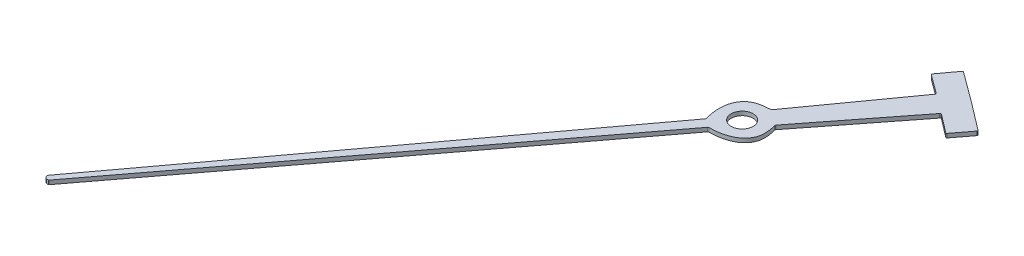
ISO-10303-21;
HEADER;
FILE_DESCRIPTION(('STEP AP214'),'2;1');
FILE_NAME('part.step','',(''),(''),'','','');
FILE_SCHEMA(('AUTOMOTIVE_DESIGN { 1 0 10303 214 1 1 1 1 }'));
ENDSEC;
DATA;
#1=APPLICATION_CONTEXT('core data for automotive mechanical design processes');
#2=APPLICATION_PROTOCOL_DEFINITION('international standard','automotive_design',2000,#1);
#3=PRODUCT_CONTEXT('',#1,'mechanical');
#4=PRODUCT('Part','Part','',(#3));
#5=PRODUCT_RELATED_PRODUCT_CATEGORY('part','',(#4));
#6=PRODUCT_DEFINITION_FORMATION('','',#4);
#7=PRODUCT_DEFINITION_CONTEXT('part definition',#1,'design');
#8=PRODUCT_DEFINITION('design','',#6,#7);
#9=PRODUCT_DEFINITION_SHAPE('','',#8);
#10=(LENGTH_UNIT() NAMED_UNIT(*) SI_UNIT(.MILLI.,.METRE.));
#11=(NAMED_UNIT(*) PLANE_ANGLE_UNIT() SI_UNIT($,.RADIAN.));
#12=(NAMED_UNIT(*) SI_UNIT($,.STERADIAN.) SOLID_ANGLE_UNIT());
#13=UNCERTAINTY_MEASURE_WITH_UNIT(LENGTH_MEASURE(1.E-05),#10,'distance_accuracy_value','');
#14=(GEOMETRIC_REPRESENTATION_CONTEXT(3) GLOBAL_UNCERTAINTY_ASSIGNED_CONTEXT((#13)) GLOBAL_UNIT_ASSIGNED_CONTEXT((#10,
#11,#12)) REPRESENTATION_CONTEXT('',''));
#15=CARTESIAN_POINT('',(0.,0.,0.));
#16=DIRECTION('',(0.,0.,1.));
#17=DIRECTION('',(1.,0.,0.));
#18=AXIS2_PLACEMENT_3D('',#15,#16,#17);
#19=CARTESIAN_POINT('',(32.1899183065593,1.05848,-47.0688155237929));
#20=DIRECTION('',(-0.605978106654896,0.,0.795481322379694));
#21=DIRECTION('',(0.795481322379694,0.,0.605978106654896));
#22=AXIS2_PLACEMENT_3D('',#19,#20,#21);
#23=PLANE('',#22);
#24=DIRECTION('',(-0.795481322379694,0.,-0.605978106654896));
#25=VECTOR('',#24,1.);
#26=CARTESIAN_POINT('',(32.1899183065593,1.05848,-47.0688155237929));
#27=LINE('',#26,#25);
#28=CARTESIAN_POINT('',(33.0273401992961,1.05848,-46.4308881221615));
#29=VERTEX_POINT('',#28);
#30=CARTESIAN_POINT('',(32.1899183065593,1.05848,-47.0688155237929));
#31=VERTEX_POINT('',#30);
#32=EDGE_CURVE('E201',#29,#31,#27,.T.);
#33=ORIENTED_EDGE('',*,*,#32,.F.);
#34=DIRECTION('',(0.,-1.,0.));
#35=VECTOR('',#34,1.);
#36=CARTESIAN_POINT('',(33.0273401992961,1.05848,-46.4308881221615));
#37=LINE('',#36,#35);
#38=CARTESIAN_POINT('',(33.0273401992961,0.941520000000001,-46.4308881221615));
#39=VERTEX_POINT('',#38);
#40=EDGE_CURVE('E311',#29,#39,#37,.T.);
#41=ORIENTED_EDGE('',*,*,#40,.T.);
#42=DIRECTION('',(-0.795481322379694,0.,-0.605978106654896));
#43=VECTOR('',#42,1.);
#44=CARTESIAN_POINT('',(32.1899183065593,0.941520000000001,-47.0688155237929));
#45=LINE('',#44,#43);
#46=CARTESIAN_POINT('',(32.1899183065593,0.941520000000001,-47.0688155237929));
#47=VERTEX_POINT('',#46);
#48=EDGE_CURVE('E225',#39,#47,#45,.T.);
#49=ORIENTED_EDGE('',*,*,#48,.T.);
#50=DIRECTION('',(0.,-1.,0.));
#51=VECTOR('',#50,1.);
#52=CARTESIAN_POINT('',(32.1899183065593,1.05848,-47.0688155237929));
#53=LINE('',#52,#51);
#54=EDGE_CURVE('E219',#31,#47,#53,.T.);
#55=ORIENTED_EDGE('',*,*,#54,.F.);
#56=EDGE_LOOP('',(#33,#41,#49,#55));
#57=FACE_BOUND('',#56,.T.);
#58=ADVANCED_FACE('F34',(#57),#23,.F.);
#59=CARTESIAN_POINT('',(32.1899183065593,1.05848,-47.0688155237929));
#60=DIRECTION('',(-0.592295470716466,0.,0.80572084208413));
#61=DIRECTION('',(0.80572084208413,0.,0.592295470716466));
#62=AXIS2_PLACEMENT_3D('',#59,#60,#61);
#63=PLANE('',#62);
#64=DIRECTION('',(-0.80572084208413,0.,-0.592295470716466));
#65=VECTOR('',#64,1.);
#66=CARTESIAN_POINT('',(32.1899183065593,0.941520000000001,-47.0688155237929));
#67=LINE('',#66,#65);
#68=CARTESIAN_POINT('',(31.3417170306612,0.941520000000001,-47.6923388928433));
#69=VERTEX_POINT('',#68);
#70=EDGE_CURVE('E456',#47,#69,#67,.T.);
#71=ORIENTED_EDGE('',*,*,#70,.T.);
#72=DIRECTION('',(0.,-1.,0.));
#73=VECTOR('',#72,1.);
#74=CARTESIAN_POINT('',(31.3417170306612,1.05848,-47.6923388928433));
#75=LINE('',#74,#73);
#76=CARTESIAN_POINT('',(31.3417170306612,1.05848,-47.6923388928433));
#77=VERTEX_POINT('',#76);
#78=EDGE_CURVE('E221',#69,#77,#75,.F.);
#79=ORIENTED_EDGE('',*,*,#78,.T.);
#80=DIRECTION('',(-0.80572084208413,0.,-0.592295470716466));
#81=VECTOR('',#80,1.);
#82=CARTESIAN_POINT('',(32.1899183065593,1.05848,-47.0688155237929));
#83=LINE('',#82,#81);
#84=EDGE_CURVE('E205',#31,#77,#83,.T.);
#85=ORIENTED_EDGE('',*,*,#84,.F.);
#86=ORIENTED_EDGE('',*,*,#54,.T.);
#87=EDGE_LOOP('',(#71,#79,#85,#86));
#88=FACE_BOUND('',#87,.T.);
#89=ADVANCED_FACE('F218',(#88),#63,.F.);
#90=CARTESIAN_POINT('',(31.3181577532387,1.05848,-47.709657612407));
#91=DIRECTION('',(0.805720842084131,0.,0.592295470716466));
#92=DIRECTION('',(0.592295470716466,0.,-0.805720842084131));
#93=AXIS2_PLACEMENT_3D('',#90,#91,#92);
#94=PLANE('',#93);
#95=DIRECTION('',(-0.592295470716465,0.,0.805720842084131));
#96=VECTOR('',#95,1.);
#97=CARTESIAN_POINT('',(31.3181577532387,0.941520000000001,-47.709657612407));
#98=LINE('',#97,#96);
#99=CARTESIAN_POINT('',(31.3008390336749,0.941520000000001,-47.6860983349845));
#100=VERTEX_POINT('',#99);
#101=CARTESIAN_POINT('',(30.936770156139,0.941520000000001,-47.1908423401513));
#102=VERTEX_POINT('',#101);
#103=EDGE_CURVE('E349',#100,#102,#98,.T.);
#104=ORIENTED_EDGE('',*,*,#103,.T.);
#105=DIRECTION('',(0.,-1.,0.));
#106=VECTOR('',#105,1.);
#107=CARTESIAN_POINT('',(30.936770156139,1.05848,-47.1908423401513));
#108=LINE('',#107,#106);
#109=CARTESIAN_POINT('',(30.936770156139,1.05848,-47.1908423401513));
#110=VERTEX_POINT('',#109);
#111=EDGE_CURVE('E308',#102,#110,#108,.F.);
#112=ORIENTED_EDGE('',*,*,#111,.T.);
#113=DIRECTION('',(-0.592295470716465,0.,0.805720842084131));
#114=VECTOR('',#113,1.);
#115=CARTESIAN_POINT('',(31.3181577532387,1.05848,-47.709657612407));
#116=LINE('',#115,#114);
#117=CARTESIAN_POINT('',(31.3008390336749,1.05848,-47.6860983349845));
#118=VERTEX_POINT('',#117);
#119=EDGE_CURVE('E222',#118,#110,#116,.T.);
#120=ORIENTED_EDGE('',*,*,#119,.F.);
#121=DIRECTION('',(0.,-1.,0.));
#122=VECTOR('',#121,1.);
#123=CARTESIAN_POINT('',(31.3008390336749,1.05848,-47.6860983349845));
#124=LINE('',#123,#122);
#125=EDGE_CURVE('E305',#118,#100,#124,.T.);
#126=ORIENTED_EDGE('',*,*,#125,.T.);
#127=EDGE_LOOP('',(#104,#112,#120,#126));
#128=FACE_BOUND('',#127,.T.);
#129=ADVANCED_FACE('F388',(#128),#94,.F.);
#130=CARTESIAN_POINT('',(30.9194514365753,1.05848,-47.1672830627287));
#131=DIRECTION('',(0.592295470716466,0.,-0.805720842084131));
#132=DIRECTION('',(-0.805720842084131,0.,-0.592295470716466));
#133=AXIS2_PLACEMENT_3D('',#130,#131,#132);
#134=PLANE('',#133);
#135=DIRECTION('',(0.805720842084131,0.,0.592295470716465));
#136=VECTOR('',#135,1.);
#137=CARTESIAN_POINT('',(30.9194514365753,0.941520000000001,-47.1672830627287));
#138=LINE('',#137,#136);
#139=CARTESIAN_POINT('',(30.9430107139978,0.941520000000001,-47.149964343165));
#140=VERTEX_POINT('',#139);
#141=CARTESIAN_POINT('',(31.4815933283321,0.941520000000001,-46.7540455256107));
#142=VERTEX_POINT('',#141);
#143=EDGE_CURVE('E338',#140,#142,#138,.T.);
#144=ORIENTED_EDGE('',*,*,#143,.T.);
#145=DIRECTION('',(0.,-1.,0.));
#146=VECTOR('',#145,1.);
#147=CARTESIAN_POINT('',(31.4815933283321,1.05848,-46.7540455256107));
#148=LINE('',#147,#146);
#149=CARTESIAN_POINT('',(31.4815933283321,1.05848,-46.7540455256107));
#150=VERTEX_POINT('',#149);
#151=EDGE_CURVE('E303',#142,#150,#148,.F.);
#152=ORIENTED_EDGE('',*,*,#151,.T.);
#153=DIRECTION('',(0.805720842084131,0.,0.592295470716465));
#154=VECTOR('',#153,1.);
#155=CARTESIAN_POINT('',(30.9194514365753,1.05848,-47.1672830627287));
#156=LINE('',#155,#154);
#157=CARTESIAN_POINT('',(30.9430107139978,1.05848,-47.149964343165));
#158=VERTEX_POINT('',#157);
#159=EDGE_CURVE('E357',#158,#150,#156,.T.);
#160=ORIENTED_EDGE('',*,*,#159,.F.);
#161=DIRECTION('',(0.,-1.,0.));
#162=VECTOR('',#161,1.);
#163=CARTESIAN_POINT('',(30.9430107139978,1.05848,-47.149964343165));
#164=LINE('',#163,#162);
#165=EDGE_CURVE('E300',#158,#140,#164,.T.);
#166=ORIENTED_EDGE('',*,*,#165,.T.);
#167=EDGE_LOOP('',(#144,#152,#160,#166));
#168=FACE_BOUND('',#167,.T.);
#169=ADVANCED_FACE('F345',(#168),#134,.F.);
#170=CARTESIAN_POINT('',(31.5048720121127,1.05848,-46.7369330739434));
#171=DIRECTION('',(0.812759322746559,0.,0.582599590875718));
#172=DIRECTION('',(0.582599590875718,0.,-0.81275932274656));
#173=AXIS2_PLACEMENT_3D('',#170,#171,#172);
#174=PLANE('',#173);
#175=DIRECTION('',(-0.582599590875718,0.,0.812759322746559));
#176=VECTOR('',#175,1.);
#177=CARTESIAN_POINT('',(31.5048720121127,0.941520000000001,-46.7369330739434));
#178=LINE('',#177,#176);
#179=CARTESIAN_POINT('',(31.4880396913655,0.941520000000001,-46.7134510361509));
#180=VERTEX_POINT('',#179);
#181=CARTESIAN_POINT('',(29.4960705640323,0.941520000000001,-43.9345416372792));
#182=VERTEX_POINT('',#181);
#183=EDGE_CURVE('E340',#180,#182,#178,.T.);
#184=ORIENTED_EDGE('',*,*,#183,.T.);
#185=DIRECTION('',(0.,1.,0.));
#186=VECTOR('',#185,1.);
#187=CARTESIAN_POINT('',(29.4960705640323,1.05848,-43.9345416372792));
#188=LINE('',#187,#186);
#189=CARTESIAN_POINT('',(29.4960705640323,1.05848,-43.9345416372792));
#190=VERTEX_POINT('',#189);
#191=EDGE_CURVE('E284',#182,#190,#188,.T.);
#192=ORIENTED_EDGE('',*,*,#191,.T.);
#193=DIRECTION('',(-0.582599590875718,0.,0.812759322746559));
#194=VECTOR('',#193,1.);
#195=CARTESIAN_POINT('',(31.5048720121127,1.05848,-46.7369330739434));
#196=LINE('',#195,#194);
#197=CARTESIAN_POINT('',(31.4880396913655,1.05848,-46.7134510361509));
#198=VERTEX_POINT('',#197);
#199=EDGE_CURVE('E355',#198,#190,#196,.T.);
#200=ORIENTED_EDGE('',*,*,#199,.F.);
#201=DIRECTION('',(0.,-1.,0.));
#202=VECTOR('',#201,1.);
#203=CARTESIAN_POINT('',(31.4880396913655,0.941520000000001,-46.7134510361509));
#204=LINE('',#203,#202);
#205=EDGE_CURVE('E281',#198,#180,#204,.T.);
#206=ORIENTED_EDGE('',*,*,#205,.T.);
#207=EDGE_LOOP('',(#184,#192,#200,#206));
#208=FACE_BOUND('',#207,.T.);
#209=ADVANCED_FACE('F359',(#208),#174,.F.);
#210=CARTESIAN_POINT('',(29.4876511575013,1.05848,-43.9227960898102));
#211=CARTESIAN_POINT('',(29.1943975643702,1.05848,-43.9146186001798));
#212=CARTESIAN_POINT('',(28.7022898602227,1.05848,-43.7554972211429));
#213=CARTESIAN_POINT('',(28.6302859125263,1.05848,-43.1735217844957));
#214=CARTESIAN_POINT('',(28.7609984101812,1.05848,-42.7426059162903));
#215=B_SPLINE_CURVE_WITH_KNOTS('',3,(#210,#211,#212,#213,#214),.UNSPECIFIED.,.F.,.F.,(4,1,4),
(0.,0.358150980857874,1.),.UNSPECIFIED.);
#216=DIRECTION('',(0.,-1.,0.));
#217=VECTOR('',#216,1.);
#218=SURFACE_OF_LINEAR_EXTRUSION('',#215,#217);
#219=CARTESIAN_POINT('',(29.4876511575013,0.941520000000001,-43.9227960898102));
#220=CARTESIAN_POINT('',(29.1943975643702,0.941520000000001,-43.9146186001798));
#221=CARTESIAN_POINT('',(28.7022898602227,0.941520000000001,-43.7554972211429));
#222=CARTESIAN_POINT('',(28.6302859125263,0.941520000000001,-43.1735217844957));
#223=CARTESIAN_POINT('',(28.7609984101812,0.941520000000001,-42.7426059162903));
#224=B_SPLINE_CURVE_WITH_KNOTS('',3,(#219,#220,#221,#222,#223),.UNSPECIFIED.,.F.,.F.,(4,1,4),
(0.,0.358150980857874,1.),.UNSPECIFIED.);
#225=CARTESIAN_POINT('',(29.4732932365023,0.941520000000001,-43.9223535377325));
#226=VERTEX_POINT('',#225);
#227=CARTESIAN_POINT('',(28.7568304404569,0.941520000000001,-42.7565297274636));
#228=VERTEX_POINT('',#227);
#229=EDGE_CURVE('E463',#226,#228,#224,.T.);
#230=ORIENTED_EDGE('',*,*,#229,.T.);
#231=DIRECTION('',(0.,-1.,0.));
#232=VECTOR('',#231,1.);
#233=CARTESIAN_POINT('',(28.7568304404569,0.941520000000001,-42.7565297274636));
#234=LINE('',#233,#232);
#235=CARTESIAN_POINT('',(28.7568304404569,1.05848,-42.7565297274636));
#236=VERTEX_POINT('',#235);
#237=EDGE_CURVE('E274',#228,#236,#234,.F.);
#238=ORIENTED_EDGE('',*,*,#237,.T.);
#239=CARTESIAN_POINT('',(29.4732932365023,1.05848,-43.9223535377325));
#240=VERTEX_POINT('',#239);
#241=EDGE_CURVE('E361',#240,#236,#215,.T.);
#242=ORIENTED_EDGE('',*,*,#241,.F.);
#243=DIRECTION('',(0.,-1.,0.));
#244=VECTOR('',#243,1.);
#245=CARTESIAN_POINT('',(29.4732932365023,1.05848,-43.9223535377325));
#246=LINE('',#245,#244);
#247=EDGE_CURVE('E271',#240,#226,#246,.T.);
#248=ORIENTED_EDGE('',*,*,#247,.T.);
#249=EDGE_LOOP('',(#230,#238,#242,#248));
#250=FACE_BOUND('',#249,.T.);
#251=ADVANCED_FACE('F377',(#250),#218,.F.);
#252=CARTESIAN_POINT('',(28.7609984101812,1.05848,-42.7426059162903));
#253=DIRECTION('',(0.803510268686839,0.,0.595290893693835));
#254=DIRECTION('',(0.595290893693835,0.,-0.803510268686839));
#255=AXIS2_PLACEMENT_3D('',#252,#253,#254);
#256=PLANE('',#255);
#257=DIRECTION('',(-0.595290893693835,0.,0.803510268686839));
#258=VECTOR('',#257,1.);
#259=CARTESIAN_POINT('',(28.7609984101812,0.941520000000001,-42.7426059162903));
#260=LINE('',#259,#258);
#261=CARTESIAN_POINT('',(28.752282512802,0.941520000000001,-42.7308413939043));
#262=VERTEX_POINT('',#261);
#263=CARTESIAN_POINT('',(20.564809879345,0.941520000000001,-31.6795748530143));
#264=VERTEX_POINT('',#263);
#265=EDGE_CURVE('E468',#262,#264,#260,.T.);
#266=ORIENTED_EDGE('',*,*,#265,.T.);
#267=DIRECTION('',(0.,-1.,0.));
#268=VECTOR('',#267,1.);
#269=CARTESIAN_POINT('',(20.564809879345,1.05848,-31.6795748530143));
#270=LINE('',#269,#268);
#271=CARTESIAN_POINT('',(20.564809879345,1.05848,-31.6795748530143));
#272=VERTEX_POINT('',#271);
#273=EDGE_CURVE('E269',#264,#272,#270,.F.);
#274=ORIENTED_EDGE('',*,*,#273,.T.);
#275=DIRECTION('',(-0.595290893693835,0.,0.803510268686839));
#276=VECTOR('',#275,1.);
#277=CARTESIAN_POINT('',(28.7609984101812,1.05848,-42.7426059162903));
#278=LINE('',#277,#276);
#279=CARTESIAN_POINT('',(28.752282512802,1.05848,-42.7308413939043));
#280=VERTEX_POINT('',#279);
#281=EDGE_CURVE('E364',#280,#272,#278,.T.);
#282=ORIENTED_EDGE('',*,*,#281,.F.);
#283=DIRECTION('',(0.,1.,0.));
#284=VECTOR('',#283,1.);
#285=CARTESIAN_POINT('',(28.752282512802,0.941520000000001,-42.7308413939043));
#286=LINE('',#285,#284);
#287=EDGE_CURVE('E266',#280,#262,#286,.F.);
#288=ORIENTED_EDGE('',*,*,#287,.T.);
#289=EDGE_LOOP('',(#266,#274,#282,#288));
#290=FACE_BOUND('',#289,.T.);
#291=ADVANCED_FACE('F381',(#290),#256,.F.);
#292=CARTESIAN_POINT('',(20.6631527987761,1.05848,-31.6660876085053));
#293=DIRECTION('',(0.,-1.,0.));
#294=DIRECTION('',(0.,0.,-1.));
#295=AXIS2_PLACEMENT_3D('',#292,#293,#294);
#296=CYLINDRICAL_SURFACE('',#295,0.104190810110918);
#297=CARTESIAN_POINT('',(20.6631527987761,0.941520000000001,-31.6660876085053));
#298=DIRECTION('',(0.,1.,0.));
#299=DIRECTION('',(0.,0.,-1.));
#300=AXIS2_PLACEMENT_3D('',#297,#298,#299);
#301=CIRCLE('',#300,0.104190810110918);
#302=CARTESIAN_POINT('',(20.5591045192301,0.941520000000001,-31.6606396331859));
#303=VERTEX_POINT('',#302);
#304=CARTESIAN_POINT('',(20.6872694274349,0.941520000000001,-31.5647263085249));
#305=VERTEX_POINT('',#304);
#306=EDGE_CURVE('E474',#303,#305,#301,.T.);
#307=ORIENTED_EDGE('',*,*,#306,.T.);
#308=DIRECTION('',(0.,-1.,0.));
#309=VECTOR('',#308,1.);
#310=CARTESIAN_POINT('',(20.6872694274349,1.05848,-31.5647263085249));
#311=LINE('',#310,#309);
#312=CARTESIAN_POINT('',(20.6872694274349,1.05848,-31.5647263085249));
#313=VERTEX_POINT('',#312);
#314=EDGE_CURVE('E254',#305,#313,#311,.F.);
#315=ORIENTED_EDGE('',*,*,#314,.T.);
#316=CARTESIAN_POINT('',(20.6631527987761,1.05848,-31.6660876085053));
#317=DIRECTION('',(0.,1.,0.));
#318=DIRECTION('',(0.,0.,-1.));
#319=AXIS2_PLACEMENT_3D('',#316,#317,#318);
#320=CIRCLE('',#319,0.104190810110918);
#321=CARTESIAN_POINT('',(20.5591045192301,1.05848,-31.6606396331859));
#322=VERTEX_POINT('',#321);
#323=EDGE_CURVE('E543',#322,#313,#320,.T.);
#324=ORIENTED_EDGE('',*,*,#323,.F.);
#325=DIRECTION('',(0.,-1.,0.));
#326=VECTOR('',#325,1.);
#327=CARTESIAN_POINT('',(20.5591045192301,1.05848,-31.6606396331859));
#328=LINE('',#327,#326);
#329=EDGE_CURVE('E251',#322,#303,#328,.T.);
#330=ORIENTED_EDGE('',*,*,#329,.T.);
#331=EDGE_LOOP('',(#307,#315,#324,#330));
#332=FACE_BOUND('',#331,.T.);
#333=ADVANCED_FACE('F526',(#332),#296,.T.);
#334=CARTESIAN_POINT('',(29.0063295391709,1.05848,-42.5590102304366));
#335=DIRECTION('',(-0.7977317376354,0.,-0.603012499679074));
#336=DIRECTION('',(-0.603012499679074,0.,0.7977317376354));
#337=AXIS2_PLACEMENT_3D('',#334,#335,#336);
#338=PLANE('',#337);
#339=DIRECTION('',(0.603012499679074,0.,-0.7977317376354));
#340=VECTOR('',#339,1.);
#341=CARTESIAN_POINT('',(29.0063295391709,1.05848,-42.5590102304366));
#342=LINE('',#341,#340);
#343=CARTESIAN_POINT('',(20.7038270379946,1.05848,-31.57554015227));
#344=VERTEX_POINT('',#343);
#345=CARTESIAN_POINT('',(28.9975005866012,1.05848,-42.5473303138866));
#346=VERTEX_POINT('',#345);
#347=EDGE_CURVE('E512',#344,#346,#342,.T.);
#348=ORIENTED_EDGE('',*,*,#347,.F.);
#349=DIRECTION('',(0.,-1.,0.));
#350=VECTOR('',#349,1.);
#351=CARTESIAN_POINT('',(20.7038270379946,1.05848,-31.57554015227));
#352=LINE('',#351,#350);
#353=CARTESIAN_POINT('',(20.7038270379946,0.941520000000001,-31.57554015227));
#354=VERTEX_POINT('',#353);
#355=EDGE_CURVE('E230',#344,#354,#352,.T.);
#356=ORIENTED_EDGE('',*,*,#355,.T.);
#357=DIRECTION('',(0.603012499679074,0.,-0.7977317376354));
#358=VECTOR('',#357,1.);
#359=CARTESIAN_POINT('',(29.0063295391709,0.941520000000001,-42.5590102304366));
#360=LINE('',#359,#358);
#361=CARTESIAN_POINT('',(28.9975005866012,0.941520000000001,-42.5473303138866));
#362=VERTEX_POINT('',#361);
#363=EDGE_CURVE('E477',#354,#362,#360,.T.);
#364=ORIENTED_EDGE('',*,*,#363,.T.);
#365=DIRECTION('',(0.,1.,0.));
#366=VECTOR('',#365,1.);
#367=CARTESIAN_POINT('',(28.9975005866012,1.05848,-42.5473303138866));
#368=LINE('',#367,#366);
#369=EDGE_CURVE('E227',#362,#346,#368,.T.);
#370=ORIENTED_EDGE('',*,*,#369,.T.);
#371=EDGE_LOOP('',(#348,#356,#364,#370));
#372=FACE_BOUND('',#371,.T.);
#373=ADVANCED_FACE('F522',(#372),#338,.F.);
#374=CARTESIAN_POINT('',(29.0063295391709,1.05848,-42.5590102304366));
#375=CARTESIAN_POINT('',(29.4566174267421,1.05848,-42.5551294030654));
#376=CARTESIAN_POINT('',(29.9946636056733,1.05848,-42.7883380793237));
#377=CARTESIAN_POINT('',(30.008542987962,1.05848,-43.3053457857414));
#378=CARTESIAN_POINT('',(29.9336858154135,1.05848,-43.5890021710722));
#379=B_SPLINE_CURVE_WITH_KNOTS('',3,(#374,#375,#376,#377,#378),.UNSPECIFIED.,.F.,.F.,(4,1,4),
(0.,0.641849019142126,1.),.UNSPECIFIED.);
#380=DIRECTION('',(0.,-1.,0.));
#381=VECTOR('',#380,1.);
#382=SURFACE_OF_LINEAR_EXTRUSION('',#379,#381);
#383=CARTESIAN_POINT('',(29.0208636129798,1.05848,-42.5589382045408));
#384=VERTEX_POINT('',#383);
#385=CARTESIAN_POINT('',(29.9373104160822,1.05848,-43.5751022423765));
#386=VERTEX_POINT('',#385);
#387=EDGE_CURVE('E504',#384,#386,#379,.T.);
#388=ORIENTED_EDGE('',*,*,#387,.F.);
#389=DIRECTION('',(0.,-1.,0.));
#390=VECTOR('',#389,1.);
#391=CARTESIAN_POINT('',(29.0208636129798,1.05848,-42.5589382045408));
#392=LINE('',#391,#390);
#393=CARTESIAN_POINT('',(29.0208636129798,0.941520000000001,-42.5589382045408));
#394=VERTEX_POINT('',#393);
#395=EDGE_CURVE('E278',#384,#394,#392,.T.);
#396=ORIENTED_EDGE('',*,*,#395,.T.);
#397=CARTESIAN_POINT('',(29.0063295391709,0.941520000000001,-42.5590102304366));
#398=CARTESIAN_POINT('',(29.4566174267421,0.941520000000001,-42.5551294030654));
#399=CARTESIAN_POINT('',(29.9946636056733,0.941520000000001,-42.7883380793237));
#400=CARTESIAN_POINT('',(30.008542987962,0.941520000000001,-43.3053457857414));
#401=CARTESIAN_POINT('',(29.9336858154135,0.941520000000001,-43.5890021710722));
#402=B_SPLINE_CURVE_WITH_KNOTS('',3,(#397,#398,#399,#400,#401),.UNSPECIFIED.,.F.,.F.,(4,1,4),
(0.,0.641849019142126,1.),.UNSPECIFIED.);
#403=CARTESIAN_POINT('',(29.9373104160822,0.941520000000001,-43.5751022423765));
#404=VERTEX_POINT('',#403);
#405=EDGE_CURVE('E480',#394,#404,#402,.T.);
#406=ORIENTED_EDGE('',*,*,#405,.T.);
#407=DIRECTION('',(0.,-1.,0.));
#408=VECTOR('',#407,1.);
#409=CARTESIAN_POINT('',(29.9373104160822,0.941520000000001,-43.5751022423765));
#410=LINE('',#409,#408);
#411=EDGE_CURVE('E276',#404,#386,#410,.F.);
#412=ORIENTED_EDGE('',*,*,#411,.T.);
#413=EDGE_LOOP('',(#388,#396,#406,#412));
#414=FACE_BOUND('',#413,.T.);
#415=ADVANCED_FACE('F517',(#414),#382,.F.);
#416=CARTESIAN_POINT('',(32.0647024833299,1.05848,-46.3179790677879));
#417=DIRECTION('',(-0.788163983086571,0.,-0.615465300212052));
#418=DIRECTION('',(-0.615465300212052,0.,0.788163983086571));
#419=AXIS2_PLACEMENT_3D('',#416,#417,#418);
#420=PLANE('',#419);
#421=DIRECTION('',(0.615465300212052,0.,-0.788163983086571));
#422=VECTOR('',#421,1.);
#423=CARTESIAN_POINT('',(32.0647024833299,1.05848,-46.3179790677879));
#424=LINE('',#423,#422);
#425=CARTESIAN_POINT('',(29.9425801789684,1.05848,-43.6003922803182));
#426=VERTEX_POINT('',#425);
#427=CARTESIAN_POINT('',(32.0469206147803,1.05848,-46.2952076323586));
#428=VERTEX_POINT('',#427);
#429=EDGE_CURVE('E503',#426,#428,#424,.T.);
#430=ORIENTED_EDGE('',*,*,#429,.F.);
#431=DIRECTION('',(0.,1.,0.));
#432=VECTOR('',#431,1.);
#433=CARTESIAN_POINT('',(29.9425801789684,0.941520000000001,-43.6003922803182));
#434=LINE('',#433,#432);
#435=CARTESIAN_POINT('',(29.9425801789684,0.941520000000001,-43.6003922803182));
#436=VERTEX_POINT('',#435);
#437=EDGE_CURVE('E288',#426,#436,#434,.F.);
#438=ORIENTED_EDGE('',*,*,#437,.T.);
#439=DIRECTION('',(0.615465300212052,0.,-0.788163983086571));
#440=VECTOR('',#439,1.);
#441=CARTESIAN_POINT('',(32.0647024833299,0.941520000000001,-46.3179790677879));
#442=LINE('',#441,#440);
#443=CARTESIAN_POINT('',(32.0469206147803,0.941520000000001,-46.2952076323586));
#444=VERTEX_POINT('',#443);
#445=EDGE_CURVE('E485',#436,#444,#442,.T.);
#446=ORIENTED_EDGE('',*,*,#445,.T.);
#447=DIRECTION('',(0.,-1.,0.));
#448=VECTOR('',#447,1.);
#449=CARTESIAN_POINT('',(32.0469206147803,1.05848,-46.2952076323586));
#450=LINE('',#449,#448);
#451=EDGE_CURVE('E286',#444,#428,#450,.F.);
#452=ORIENTED_EDGE('',*,*,#451,.T.);
#453=EDGE_LOOP('',(#430,#438,#446,#452));
#454=FACE_BOUND('',#453,.T.);
#455=ADVANCED_FACE('F521',(#454),#420,.F.);
#456=CARTESIAN_POINT('',(32.6426832295797,1.05848,-45.8776875506374));
#457=DIRECTION('',(0.605978106654896,0.,-0.795481322379694));
#458=DIRECTION('',(-0.795481322379694,0.,-0.605978106654896));
#459=AXIS2_PLACEMENT_3D('',#456,#457,#458);
#460=PLANE('',#459);
#461=DIRECTION('',(0.795481322379694,0.,0.605978106654896));
#462=VECTOR('',#461,1.);
#463=CARTESIAN_POINT('',(32.6426832295797,0.941520000000001,-45.8776875506374));
#464=LINE('',#463,#462);
#465=CARTESIAN_POINT('',(32.0876853294843,0.941520000000001,-46.3004713008468));
#466=VERTEX_POINT('',#465);
#467=CARTESIAN_POINT('',(32.6194233557133,0.941520000000001,-45.895406350476));
#468=VERTEX_POINT('',#467);
#469=EDGE_CURVE('E490',#466,#468,#464,.T.);
#470=ORIENTED_EDGE('',*,*,#469,.T.);
#471=DIRECTION('',(0.,-1.,0.));
#472=VECTOR('',#471,1.);
#473=CARTESIAN_POINT('',(32.6194233557133,1.05848,-45.895406350476));
#474=LINE('',#473,#472);
#475=CARTESIAN_POINT('',(32.6194233557133,1.05848,-45.895406350476));
#476=VERTEX_POINT('',#475);
#477=EDGE_CURVE('E298',#468,#476,#474,.F.);
#478=ORIENTED_EDGE('',*,*,#477,.T.);
#479=DIRECTION('',(0.795481322379694,0.,0.605978106654896));
#480=VECTOR('',#479,1.);
#481=CARTESIAN_POINT('',(32.6426832295797,1.05848,-45.8776875506374));
#482=LINE('',#481,#480);
#483=CARTESIAN_POINT('',(32.0876853294843,1.05848,-46.3004713008468));
#484=VERTEX_POINT('',#483);
#485=EDGE_CURVE('E232',#484,#476,#482,.T.);
#486=ORIENTED_EDGE('',*,*,#485,.F.);
#487=DIRECTION('',(0.,-1.,0.));
#488=VECTOR('',#487,1.);
#489=CARTESIAN_POINT('',(32.0876853294843,0.941520000000001,-46.3004713008468));
#490=LINE('',#489,#488);
#491=EDGE_CURVE('E295',#484,#466,#490,.T.);
#492=ORIENTED_EDGE('',*,*,#491,.T.);
#493=EDGE_LOOP('',(#470,#478,#486,#492));
#494=FACE_BOUND('',#493,.T.);
#495=ADVANCED_FACE('F499',(#494),#460,.F.);
#496=CARTESIAN_POINT('',(33.0506000731625,1.05848,-46.4131693223229));
#497=DIRECTION('',(-0.795481322379694,0.,-0.605978106654897));
#498=DIRECTION('',(-0.605978106654897,0.,0.795481322379694));
#499=AXIS2_PLACEMENT_3D('',#496,#497,#498);
#500=PLANE('',#499);
#501=DIRECTION('',(0.605978106654897,0.,-0.795481322379694));
#502=VECTOR('',#501,1.);
#503=CARTESIAN_POINT('',(33.0506000731625,1.05848,-46.4131693223229));
#504=LINE('',#503,#502);
#505=CARTESIAN_POINT('',(32.6604020294183,1.05848,-45.9009474245038));
#506=VERTEX_POINT('',#505);
#507=CARTESIAN_POINT('',(33.0328812733239,1.05848,-46.3899094484565));
#508=VERTEX_POINT('',#507);
#509=EDGE_CURVE('E228',#506,#508,#504,.T.);
#510=ORIENTED_EDGE('',*,*,#509,.F.);
#511=DIRECTION('',(0.,-1.,0.));
#512=VECTOR('',#511,1.);
#513=CARTESIAN_POINT('',(32.6604020294183,1.05848,-45.9009474245038));
#514=LINE('',#513,#512);
#515=CARTESIAN_POINT('',(32.6604020294183,0.941520000000001,-45.9009474245038));
#516=VERTEX_POINT('',#515);
#517=EDGE_CURVE('E292',#506,#516,#514,.T.);
#518=ORIENTED_EDGE('',*,*,#517,.T.);
#519=DIRECTION('',(0.605978106654897,0.,-0.795481322379694));
#520=VECTOR('',#519,1.);
#521=CARTESIAN_POINT('',(33.0506000731625,0.941520000000001,-46.4131693223229));
#522=LINE('',#521,#520);
#523=CARTESIAN_POINT('',(33.0328812733239,0.941520000000001,-46.3899094484565));
#524=VERTEX_POINT('',#523);
#525=EDGE_CURVE('E213',#516,#524,#522,.T.);
#526=ORIENTED_EDGE('',*,*,#525,.T.);
#527=DIRECTION('',(0.,-1.,0.));
#528=VECTOR('',#527,1.);
#529=CARTESIAN_POINT('',(33.0328812733239,1.05848,-46.3899094484565));
#530=LINE('',#529,#528);
#531=EDGE_CURVE('E49',#524,#508,#530,.F.);
#532=ORIENTED_EDGE('',*,*,#531,.T.);
#533=EDGE_LOOP('',(#510,#518,#526,#532));
#534=FACE_BOUND('',#533,.T.);
#535=ADVANCED_FACE('F496',(#534),#500,.F.);
#536=CARTESIAN_POINT('',(29.8151281235502,1.05848,-42.8121850549404));
#537=DIRECTION('',(0.,-1.,0.));
#538=DIRECTION('',(0.,0.,-1.));
#539=AXIS2_PLACEMENT_3D('',#536,#537,#538);
#540=PLANE('',#539);
#541=CARTESIAN_POINT('',(29.3208981962811,1.05848,-43.2350656212496));
#542=DIRECTION('',(0.,1.,0.));
#543=DIRECTION('',(0.,0.,1.));
#544=AXIS2_PLACEMENT_3D('',#541,#542,#543);
#545=CIRCLE('',#544,0.32164);
#546=CARTESIAN_POINT('',(29.3208981962811,1.05848,-42.9134256212496));
#547=VERTEX_POINT('',#546);
#548=EDGE_CURVE('E449',#547,#547,#545,.T.);
#549=ORIENTED_EDGE('',*,*,#548,.F.);
#550=EDGE_LOOP('',(#549));
#551=FACE_BOUND('',#550,.T.);
#552=ORIENTED_EDGE('',*,*,#323,.T.);
#553=CARTESIAN_POINT('',(20.6805013619862,1.05848,-31.5931722377606));
#554=DIRECTION('',(0.,-1.,0.));
#555=DIRECTION('',(0.,0.,-1.));
#556=AXIS2_PLACEMENT_3D('',#553,#554,#555);
#557=CIRCLE('',#556,0.02924);
#558=EDGE_CURVE('E264',#313,#344,#557,.F.);
#559=ORIENTED_EDGE('',*,*,#558,.T.);
#560=ORIENTED_EDGE('',*,*,#347,.T.);
#561=CARTESIAN_POINT('',(29.0208262626097,1.05848,-42.529698228396));
#562=DIRECTION('',(0.,-1.,0.));
#563=DIRECTION('',(0.,0.,-1.));
#564=AXIS2_PLACEMENT_3D('',#561,#562,#563);
#565=CIRCLE('',#564,0.02924);
#566=EDGE_CURVE('E319',#346,#384,#565,.T.);
#567=ORIENTED_EDGE('',*,*,#566,.T.);
#568=ORIENTED_EDGE('',*,*,#387,.T.);
#569=CARTESIAN_POINT('',(29.9656260938339,1.05848,-43.58239607494));
#570=DIRECTION('',(0.,-1.,0.));
#571=DIRECTION('',(0.,0.,-1.));
#572=AXIS2_PLACEMENT_3D('',#569,#570,#571);
#573=CIRCLE('',#572,0.02924);
#574=EDGE_CURVE('E327',#386,#426,#573,.T.);
#575=ORIENTED_EDGE('',*,*,#574,.T.);
#576=ORIENTED_EDGE('',*,*,#429,.T.);
#577=CARTESIAN_POINT('',(32.0699665296458,1.05848,-46.2772114269804));
#578=DIRECTION('',(0.,-1.,0.));
#579=DIRECTION('',(0.,0.,-1.));
#580=AXIS2_PLACEMENT_3D('',#577,#578,#579);
#581=CIRCLE('',#580,0.02924);
#582=EDGE_CURVE('E331',#428,#484,#581,.T.);
#583=ORIENTED_EDGE('',*,*,#582,.T.);
#584=ORIENTED_EDGE('',*,*,#485,.T.);
#585=CARTESIAN_POINT('',(32.6371421555519,1.05848,-45.9186662243424));
#586=DIRECTION('',(0.,-1.,0.));
#587=DIRECTION('',(0.,0.,-1.));
#588=AXIS2_PLACEMENT_3D('',#585,#586,#587);
#589=CIRCLE('',#588,0.02924);
#590=EDGE_CURVE('E56',#476,#506,#589,.F.);
#591=ORIENTED_EDGE('',*,*,#590,.T.);
#592=ORIENTED_EDGE('',*,*,#509,.T.);
#593=CARTESIAN_POINT('',(33.0096213994575,1.05848,-46.4076282482951));
#594=DIRECTION('',(0.,-1.,0.));
#595=DIRECTION('',(0.,0.,-1.));
#596=AXIS2_PLACEMENT_3D('',#593,#594,#595);
#597=CIRCLE('',#596,0.02924);
#598=EDGE_CURVE('E208',#508,#29,#597,.F.);
#599=ORIENTED_EDGE('',*,*,#598,.T.);
#600=ORIENTED_EDGE('',*,*,#32,.T.);
#601=ORIENTED_EDGE('',*,*,#84,.T.);
#602=CARTESIAN_POINT('',(31.3243983110975,1.05848,-47.6687796154207));
#603=DIRECTION('',(0.,-1.,0.));
#604=DIRECTION('',(0.,0.,-1.));
#605=AXIS2_PLACEMENT_3D('',#602,#603,#604);
#606=CIRCLE('',#605,0.02924);
#607=EDGE_CURVE('E257',#77,#118,#606,.F.);
#608=ORIENTED_EDGE('',*,*,#607,.T.);
#609=ORIENTED_EDGE('',*,*,#119,.T.);
#610=CARTESIAN_POINT('',(30.9603294335616,1.05848,-47.1735236205875));
#611=DIRECTION('',(0.,-1.,0.));
#612=DIRECTION('',(0.,0.,-1.));
#613=AXIS2_PLACEMENT_3D('',#610,#611,#612);
#614=CIRCLE('',#613,0.02924);
#615=EDGE_CURVE('E259',#110,#158,#614,.F.);
#616=ORIENTED_EDGE('',*,*,#615,.T.);
#617=ORIENTED_EDGE('',*,*,#159,.T.);
#618=CARTESIAN_POINT('',(31.4642746087683,1.05848,-46.7304862481881));
#619=DIRECTION('',(0.,-1.,0.));
#620=DIRECTION('',(0.,0.,-1.));
#621=AXIS2_PLACEMENT_3D('',#618,#619,#620);
#622=CIRCLE('',#621,0.02924);
#623=EDGE_CURVE('E11',#150,#198,#622,.T.);
#624=ORIENTED_EDGE('',*,*,#623,.T.);
#625=ORIENTED_EDGE('',*,*,#199,.T.);
#626=CARTESIAN_POINT('',(29.4723054814352,1.05848,-43.9515768493164));
#627=DIRECTION('',(0.,-1.,0.));
#628=DIRECTION('',(0.,0.,-1.));
#629=AXIS2_PLACEMENT_3D('',#626,#627,#628);
#630=CIRCLE('',#629,0.02924);
#631=EDGE_CURVE('E323',#190,#240,#630,.T.);
#632=ORIENTED_EDGE('',*,*,#631,.T.);
#633=ORIENTED_EDGE('',*,*,#241,.T.);
#634=CARTESIAN_POINT('',(28.7287878725456,1.05848,-42.7482476996359));
#635=DIRECTION('',(0.,-1.,0.));
#636=DIRECTION('',(0.,0.,-1.));
#637=AXIS2_PLACEMENT_3D('',#634,#635,#636);
#638=CIRCLE('',#637,0.02924);
#639=EDGE_CURVE('E315',#236,#280,#638,.T.);
#640=ORIENTED_EDGE('',*,*,#639,.T.);
#641=ORIENTED_EDGE('',*,*,#281,.T.);
#642=CARTESIAN_POINT('',(20.5883045196014,1.05848,-31.6621685472827));
#643=DIRECTION('',(0.,-1.,0.));
#644=DIRECTION('',(0.,0.,-1.));
#645=AXIS2_PLACEMENT_3D('',#642,#643,#644);
#646=CIRCLE('',#645,0.02924);
#647=EDGE_CURVE('E262',#272,#322,#646,.F.);
#648=ORIENTED_EDGE('',*,*,#647,.T.);
#649=EDGE_LOOP('',(#552,#559,#560,#567,#568,#575,#576,#583,#584,#591,#592,#599,#600,#601,#608,
#609,#616,#617,#624,#625,#632,#633,#640,#641,#648));
#650=FACE_BOUND('',#649,.T.);
#651=ADVANCED_FACE('F204',(#551,#650),#540,.F.);
#652=CARTESIAN_POINT('',(29.8151281235502,0.941520000000001,-42.8121850549404));
#653=DIRECTION('',(0.,-1.,0.));
#654=DIRECTION('',(0.,0.,-1.));
#655=AXIS2_PLACEMENT_3D('',#652,#653,#654);
#656=PLANE('',#655);
#657=CARTESIAN_POINT('',(29.3208981962811,0.941520000000001,-43.2350656212496));
#658=DIRECTION('',(0.,1.,0.));
#659=DIRECTION('',(0.,0.,1.));
#660=AXIS2_PLACEMENT_3D('',#657,#658,#659);
#661=CIRCLE('',#660,0.32164);
#662=CARTESIAN_POINT('',(29.3208981962811,0.941520000000001,-42.9134256212496));
#663=VERTEX_POINT('',#662);
#664=EDGE_CURVE('E452',#663,#663,#661,.T.);
#665=ORIENTED_EDGE('',*,*,#664,.T.);
#666=EDGE_LOOP('',(#665));
#667=FACE_BOUND('',#666,.T.);
#668=ORIENTED_EDGE('',*,*,#363,.F.);
#669=CARTESIAN_POINT('',(20.6805013619862,0.941520000000001,-31.5931722377606));
#670=DIRECTION('',(0.,-1.,0.));
#671=DIRECTION('',(0.,0.,-1.));
#672=AXIS2_PLACEMENT_3D('',#669,#670,#671);
#673=CIRCLE('',#672,0.02924);
#674=EDGE_CURVE('E249',#354,#305,#673,.T.);
#675=ORIENTED_EDGE('',*,*,#674,.T.);
#676=ORIENTED_EDGE('',*,*,#306,.F.);
#677=CARTESIAN_POINT('',(20.5883045196014,0.941520000000001,-31.6621685472827));
#678=DIRECTION('',(0.,-1.,0.));
#679=DIRECTION('',(0.,0.,-1.));
#680=AXIS2_PLACEMENT_3D('',#677,#678,#679);
#681=CIRCLE('',#680,0.02924);
#682=EDGE_CURVE('E247',#303,#264,#681,.T.);
#683=ORIENTED_EDGE('',*,*,#682,.T.);
#684=ORIENTED_EDGE('',*,*,#265,.F.);
#685=CARTESIAN_POINT('',(28.7287878725456,0.941520000000001,-42.7482476996359));
#686=DIRECTION('',(0.,-1.,0.));
#687=DIRECTION('',(0.,0.,-1.));
#688=AXIS2_PLACEMENT_3D('',#685,#686,#687);
#689=CIRCLE('',#688,0.02924);
#690=EDGE_CURVE('E313',#262,#228,#689,.F.);
#691=ORIENTED_EDGE('',*,*,#690,.T.);
#692=ORIENTED_EDGE('',*,*,#229,.F.);
#693=CARTESIAN_POINT('',(29.4723054814352,0.941520000000001,-43.9515768493164));
#694=DIRECTION('',(0.,-1.,0.));
#695=DIRECTION('',(0.,0.,-1.));
#696=AXIS2_PLACEMENT_3D('',#693,#694,#695);
#697=CIRCLE('',#696,0.02924);
#698=EDGE_CURVE('E321',#226,#182,#697,.F.);
#699=ORIENTED_EDGE('',*,*,#698,.T.);
#700=ORIENTED_EDGE('',*,*,#183,.F.);
#701=CARTESIAN_POINT('',(31.4642746087683,0.941520000000001,-46.7304862481881));
#702=DIRECTION('',(0.,-1.,0.));
#703=DIRECTION('',(0.,0.,-1.));
#704=AXIS2_PLACEMENT_3D('',#701,#702,#703);
#705=CIRCLE('',#704,0.02924);
#706=EDGE_CURVE('E42',#180,#142,#705,.F.);
#707=ORIENTED_EDGE('',*,*,#706,.T.);
#708=ORIENTED_EDGE('',*,*,#143,.F.);
#709=CARTESIAN_POINT('',(30.9603294335616,0.941520000000001,-47.1735236205875));
#710=DIRECTION('',(0.,-1.,0.));
#711=DIRECTION('',(0.,0.,-1.));
#712=AXIS2_PLACEMENT_3D('',#709,#710,#711);
#713=CIRCLE('',#712,0.02924);
#714=EDGE_CURVE('E243',#140,#102,#713,.T.);
#715=ORIENTED_EDGE('',*,*,#714,.T.);
#716=ORIENTED_EDGE('',*,*,#103,.F.);
#717=CARTESIAN_POINT('',(31.3243983110975,0.941520000000001,-47.6687796154207));
#718=DIRECTION('',(0.,-1.,0.));
#719=DIRECTION('',(0.,0.,-1.));
#720=AXIS2_PLACEMENT_3D('',#717,#718,#719);
#721=CIRCLE('',#720,0.02924);
#722=EDGE_CURVE('E241',#100,#69,#721,.T.);
#723=ORIENTED_EDGE('',*,*,#722,.T.);
#724=ORIENTED_EDGE('',*,*,#70,.F.);
#725=ORIENTED_EDGE('',*,*,#48,.F.);
#726=CARTESIAN_POINT('',(33.0096213994575,0.941520000000001,-46.4076282482951));
#727=DIRECTION('',(0.,-1.,0.));
#728=DIRECTION('',(0.,0.,-1.));
#729=AXIS2_PLACEMENT_3D('',#726,#727,#728);
#730=CIRCLE('',#729,0.02924);
#731=EDGE_CURVE('E239',#39,#524,#730,.T.);
#732=ORIENTED_EDGE('',*,*,#731,.T.);
#733=ORIENTED_EDGE('',*,*,#525,.F.);
#734=CARTESIAN_POINT('',(32.6371421555519,0.941520000000001,-45.9186662243424));
#735=DIRECTION('',(0.,-1.,0.));
#736=DIRECTION('',(0.,0.,-1.));
#737=AXIS2_PLACEMENT_3D('',#734,#735,#736);
#738=CIRCLE('',#737,0.02924);
#739=EDGE_CURVE('E245',#516,#468,#738,.T.);
#740=ORIENTED_EDGE('',*,*,#739,.T.);
#741=ORIENTED_EDGE('',*,*,#469,.F.);
#742=CARTESIAN_POINT('',(32.0699665296458,0.941520000000001,-46.2772114269804));
#743=DIRECTION('',(0.,-1.,0.));
#744=DIRECTION('',(0.,0.,-1.));
#745=AXIS2_PLACEMENT_3D('',#742,#743,#744);
#746=CIRCLE('',#745,0.02924);
#747=EDGE_CURVE('E329',#466,#444,#746,.F.);
#748=ORIENTED_EDGE('',*,*,#747,.T.);
#749=ORIENTED_EDGE('',*,*,#445,.F.);
#750=CARTESIAN_POINT('',(29.9656260938339,0.941520000000001,-43.58239607494));
#751=DIRECTION('',(0.,-1.,0.));
#752=DIRECTION('',(0.,0.,-1.));
#753=AXIS2_PLACEMENT_3D('',#750,#751,#752);
#754=CIRCLE('',#753,0.02924);
#755=EDGE_CURVE('E325',#436,#404,#754,.F.);
#756=ORIENTED_EDGE('',*,*,#755,.T.);
#757=ORIENTED_EDGE('',*,*,#405,.F.);
#758=CARTESIAN_POINT('',(29.0208262626097,0.941520000000001,-42.529698228396));
#759=DIRECTION('',(0.,-1.,0.));
#760=DIRECTION('',(0.,0.,-1.));
#761=AXIS2_PLACEMENT_3D('',#758,#759,#760);
#762=CIRCLE('',#761,0.02924);
#763=EDGE_CURVE('E317',#394,#362,#762,.F.);
#764=ORIENTED_EDGE('',*,*,#763,.T.);
#765=EDGE_LOOP('',(#668,#675,#676,#683,#684,#691,#692,#699,#700,#707,#708,#715,#716,#723,#724,
#725,#732,#733,#740,#741,#748,#749,#756,#757,#764));
#766=FACE_BOUND('',#765,.T.);
#767=ADVANCED_FACE('F337',(#667,#766),#656,.T.);
#768=CARTESIAN_POINT('',(20.6805013619862,1.05848,-31.5931722377606));
#769=DIRECTION('',(0.,-1.,0.));
#770=DIRECTION('',(0.,0.,-1.));
#771=AXIS2_PLACEMENT_3D('',#768,#769,#770);
#772=CYLINDRICAL_SURFACE('',#771,0.02924);
#773=ORIENTED_EDGE('',*,*,#558,.F.);
#774=ORIENTED_EDGE('',*,*,#314,.F.);
#775=ORIENTED_EDGE('',*,*,#674,.F.);
#776=ORIENTED_EDGE('',*,*,#355,.F.);
#777=EDGE_LOOP('',(#773,#774,#775,#776));
#778=FACE_BOUND('',#777,.T.);
#779=ADVANCED_FACE('F396',(#778),#772,.T.);
#780=CARTESIAN_POINT('',(20.5883045196014,1.05848,-31.6621685472827));
#781=DIRECTION('',(0.,-1.,0.));
#782=DIRECTION('',(0.,0.,-1.));
#783=AXIS2_PLACEMENT_3D('',#780,#781,#782);
#784=CYLINDRICAL_SURFACE('',#783,0.02924);
#785=ORIENTED_EDGE('',*,*,#647,.F.);
#786=ORIENTED_EDGE('',*,*,#273,.F.);
#787=ORIENTED_EDGE('',*,*,#682,.F.);
#788=ORIENTED_EDGE('',*,*,#329,.F.);
#789=EDGE_LOOP('',(#785,#786,#787,#788));
#790=FACE_BOUND('',#789,.T.);
#791=ADVANCED_FACE('F399',(#790),#784,.T.);
#792=CARTESIAN_POINT('',(28.7287878725456,1.,-42.7482476996359));
#793=DIRECTION('',(0.,-1.,0.));
#794=DIRECTION('',(0.,0.,-1.));
#795=AXIS2_PLACEMENT_3D('',#792,#793,#794);
#796=CYLINDRICAL_SURFACE('',#795,0.02924);
#797=ORIENTED_EDGE('',*,*,#639,.F.);
#798=ORIENTED_EDGE('',*,*,#237,.F.);
#799=ORIENTED_EDGE('',*,*,#690,.F.);
#800=ORIENTED_EDGE('',*,*,#287,.F.);
#801=EDGE_LOOP('',(#797,#798,#799,#800));
#802=FACE_BOUND('',#801,.T.);
#803=ADVANCED_FACE('F403',(#802),#796,.F.);
#804=CARTESIAN_POINT('',(29.0208262626097,1.,-42.529698228396));
#805=DIRECTION('',(0.,-1.,0.));
#806=DIRECTION('',(0.,0.,-1.));
#807=AXIS2_PLACEMENT_3D('',#804,#805,#806);
#808=CYLINDRICAL_SURFACE('',#807,0.02924);
#809=ORIENTED_EDGE('',*,*,#566,.F.);
#810=ORIENTED_EDGE('',*,*,#369,.F.);
#811=ORIENTED_EDGE('',*,*,#763,.F.);
#812=ORIENTED_EDGE('',*,*,#395,.F.);
#813=EDGE_LOOP('',(#809,#810,#811,#812));
#814=FACE_BOUND('',#813,.T.);
#815=ADVANCED_FACE('F407',(#814),#808,.F.);
#816=CARTESIAN_POINT('',(29.4723054814352,1.,-43.9515768493164));
#817=DIRECTION('',(0.,-1.,0.));
#818=DIRECTION('',(0.,0.,-1.));
#819=AXIS2_PLACEMENT_3D('',#816,#817,#818);
#820=CYLINDRICAL_SURFACE('',#819,0.02924);
#821=ORIENTED_EDGE('',*,*,#631,.F.);
#822=ORIENTED_EDGE('',*,*,#191,.F.);
#823=ORIENTED_EDGE('',*,*,#698,.F.);
#824=ORIENTED_EDGE('',*,*,#247,.F.);
#825=EDGE_LOOP('',(#821,#822,#823,#824));
#826=FACE_BOUND('',#825,.T.);
#827=ADVANCED_FACE('F411',(#826),#820,.F.);
#828=CARTESIAN_POINT('',(29.9656260938339,1.,-43.58239607494));
#829=DIRECTION('',(0.,-1.,0.));
#830=DIRECTION('',(0.,0.,-1.));
#831=AXIS2_PLACEMENT_3D('',#828,#829,#830);
#832=CYLINDRICAL_SURFACE('',#831,0.02924);
#833=ORIENTED_EDGE('',*,*,#574,.F.);
#834=ORIENTED_EDGE('',*,*,#411,.F.);
#835=ORIENTED_EDGE('',*,*,#755,.F.);
#836=ORIENTED_EDGE('',*,*,#437,.F.);
#837=EDGE_LOOP('',(#833,#834,#835,#836));
#838=FACE_BOUND('',#837,.T.);
#839=ADVANCED_FACE('F415',(#838),#832,.F.);
#840=CARTESIAN_POINT('',(32.6371421555519,1.05848,-45.9186662243424));
#841=DIRECTION('',(0.,-1.,0.));
#842=DIRECTION('',(0.,0.,-1.));
#843=AXIS2_PLACEMENT_3D('',#840,#841,#842);
#844=CYLINDRICAL_SURFACE('',#843,0.02924);
#845=ORIENTED_EDGE('',*,*,#590,.F.);
#846=ORIENTED_EDGE('',*,*,#477,.F.);
#847=ORIENTED_EDGE('',*,*,#739,.F.);
#848=ORIENTED_EDGE('',*,*,#517,.F.);
#849=EDGE_LOOP('',(#845,#846,#847,#848));
#850=FACE_BOUND('',#849,.T.);
#851=ADVANCED_FACE('F419',(#850),#844,.T.);
#852=CARTESIAN_POINT('',(32.0699665296458,1.05848,-46.2772114269804));
#853=DIRECTION('',(0.,1.,0.));
#854=DIRECTION('',(0.,0.,1.));
#855=AXIS2_PLACEMENT_3D('',#852,#853,#854);
#856=CYLINDRICAL_SURFACE('',#855,0.02924);
#857=ORIENTED_EDGE('',*,*,#582,.F.);
#858=ORIENTED_EDGE('',*,*,#451,.F.);
#859=ORIENTED_EDGE('',*,*,#747,.F.);
#860=ORIENTED_EDGE('',*,*,#491,.F.);
#861=EDGE_LOOP('',(#857,#858,#859,#860));
#862=FACE_BOUND('',#861,.T.);
#863=ADVANCED_FACE('F423',(#862),#856,.F.);
#864=CARTESIAN_POINT('',(31.4642746087683,1.05848,-46.7304862481881));
#865=DIRECTION('',(0.,1.,0.));
#866=DIRECTION('',(0.,0.,1.));
#867=AXIS2_PLACEMENT_3D('',#864,#865,#866);
#868=CYLINDRICAL_SURFACE('',#867,0.02924);
#869=ORIENTED_EDGE('',*,*,#623,.F.);
#870=ORIENTED_EDGE('',*,*,#151,.F.);
#871=ORIENTED_EDGE('',*,*,#706,.F.);
#872=ORIENTED_EDGE('',*,*,#205,.F.);
#873=EDGE_LOOP('',(#869,#870,#871,#872));
#874=FACE_BOUND('',#873,.T.);
#875=ADVANCED_FACE('F352',(#874),#868,.F.);
#876=CARTESIAN_POINT('',(30.9603294335616,1.05848,-47.1735236205875));
#877=DIRECTION('',(0.,-1.,0.));
#878=DIRECTION('',(0.,0.,-1.));
#879=AXIS2_PLACEMENT_3D('',#876,#877,#878);
#880=CYLINDRICAL_SURFACE('',#879,0.02924);
#881=ORIENTED_EDGE('',*,*,#615,.F.);
#882=ORIENTED_EDGE('',*,*,#111,.F.);
#883=ORIENTED_EDGE('',*,*,#714,.F.);
#884=ORIENTED_EDGE('',*,*,#165,.F.);
#885=EDGE_LOOP('',(#881,#882,#883,#884));
#886=FACE_BOUND('',#885,.T.);
#887=ADVANCED_FACE('F430',(#886),#880,.T.);
#888=CARTESIAN_POINT('',(31.3243983110975,1.05848,-47.6687796154207));
#889=DIRECTION('',(0.,-1.,0.));
#890=DIRECTION('',(0.,0.,-1.));
#891=AXIS2_PLACEMENT_3D('',#888,#889,#890);
#892=CYLINDRICAL_SURFACE('',#891,0.02924);
#893=ORIENTED_EDGE('',*,*,#607,.F.);
#894=ORIENTED_EDGE('',*,*,#78,.F.);
#895=ORIENTED_EDGE('',*,*,#722,.F.);
#896=ORIENTED_EDGE('',*,*,#125,.F.);
#897=EDGE_LOOP('',(#893,#894,#895,#896));
#898=FACE_BOUND('',#897,.T.);
#899=ADVANCED_FACE('F432',(#898),#892,.T.);
#900=CARTESIAN_POINT('',(33.0096213994575,1.05848,-46.4076282482951));
#901=DIRECTION('',(0.,-1.,0.));
#902=DIRECTION('',(0.,0.,-1.));
#903=AXIS2_PLACEMENT_3D('',#900,#901,#902);
#904=CYLINDRICAL_SURFACE('',#903,0.02924);
#905=ORIENTED_EDGE('',*,*,#598,.F.);
#906=ORIENTED_EDGE('',*,*,#531,.F.);
#907=ORIENTED_EDGE('',*,*,#731,.F.);
#908=ORIENTED_EDGE('',*,*,#40,.F.);
#909=EDGE_LOOP('',(#905,#906,#907,#908));
#910=FACE_BOUND('',#909,.T.);
#911=ADVANCED_FACE('F36',(#910),#904,.T.);
#912=CARTESIAN_POINT('',(29.3208981962811,0.941520000000001,-43.2350656212496));
#913=DIRECTION('',(0.,1.,0.));
#914=DIRECTION('',(0.,0.,1.));
#915=AXIS2_PLACEMENT_3D('',#912,#913,#914);
#916=CYLINDRICAL_SURFACE('',#915,0.32164);
#917=ORIENTED_EDGE('',*,*,#664,.F.);
#918=EDGE_LOOP('',(#917));
#919=FACE_BOUND('',#918,.T.);
#920=ORIENTED_EDGE('',*,*,#548,.T.);
#921=EDGE_LOOP('',(#920));
#922=FACE_BOUND('',#921,.T.);
#923=ADVANCED_FACE('F439',(#919,#922),#916,.F.);
#924=CLOSED_SHELL('',(#58,#89,#129,#169,#209,#251,#291,#333,#373,#415,#455,#495,#535,#651,#767,
#779,#791,#803,#815,#827,#839,#851,#863,#875,#887,#899,#911,#923));
#925=MANIFOLD_SOLID_BREP('B2',#924);
#926=ADVANCED_BREP_SHAPE_REPRESENTATION('',(#18,#925),#14);
#927=SHAPE_DEFINITION_REPRESENTATION(#9,#926);
ENDSEC;
END-ISO-10303-21;
